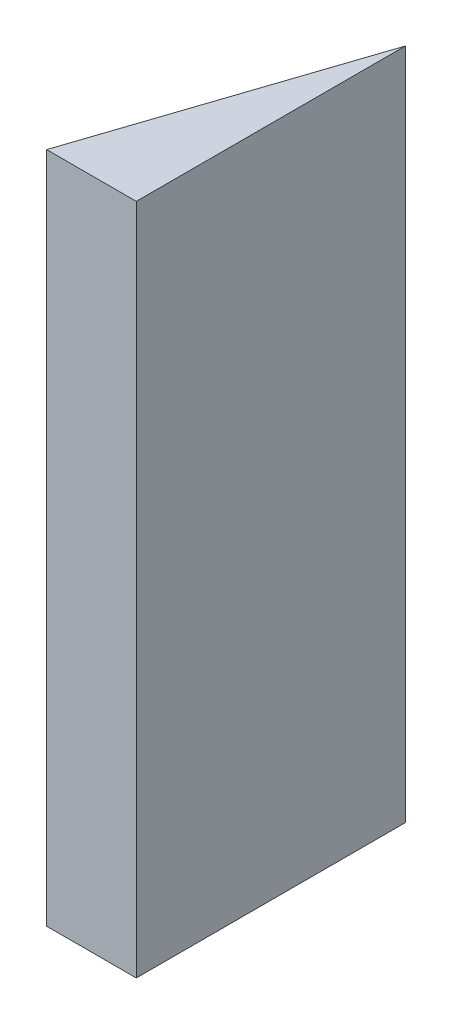
ISO-10303-21;
HEADER;
FILE_DESCRIPTION(('STEP AP214'),'2;1');
FILE_NAME('part.step','',(''),(''),'','','');
FILE_SCHEMA(('AUTOMOTIVE_DESIGN { 1 0 10303 214 1 1 1 1 }'));
ENDSEC;
DATA;
#1=APPLICATION_CONTEXT('core data for automotive mechanical design processes');
#2=APPLICATION_PROTOCOL_DEFINITION('international standard','automotive_design',2000,#1);
#3=PRODUCT_CONTEXT('',#1,'mechanical');
#4=PRODUCT('Part','Part','',(#3));
#5=PRODUCT_RELATED_PRODUCT_CATEGORY('part','',(#4));
#6=PRODUCT_DEFINITION_FORMATION('','',#4);
#7=PRODUCT_DEFINITION_CONTEXT('part definition',#1,'design');
#8=PRODUCT_DEFINITION('design','',#6,#7);
#9=PRODUCT_DEFINITION_SHAPE('','',#8);
#10=(LENGTH_UNIT() NAMED_UNIT(*) SI_UNIT(.MILLI.,.METRE.));
#11=(NAMED_UNIT(*) PLANE_ANGLE_UNIT() SI_UNIT($,.RADIAN.));
#12=(NAMED_UNIT(*) SI_UNIT($,.STERADIAN.) SOLID_ANGLE_UNIT());
#13=UNCERTAINTY_MEASURE_WITH_UNIT(LENGTH_MEASURE(1.E-05),#10,'distance_accuracy_value','');
#14=(GEOMETRIC_REPRESENTATION_CONTEXT(3) GLOBAL_UNCERTAINTY_ASSIGNED_CONTEXT((#13)) GLOBAL_UNIT_ASSIGNED_CONTEXT((#10,
#11,#12)) REPRESENTATION_CONTEXT('',''));
#15=CARTESIAN_POINT('',(0.,0.,0.));
#16=DIRECTION('',(0.,0.,1.));
#17=DIRECTION('',(1.,0.,0.));
#18=AXIS2_PLACEMENT_3D('',#15,#16,#17);
#19=CARTESIAN_POINT('',(3.92,1.74999981815962,-3.67112136800623));
#20=DIRECTION('',(0.,1.,8.74227765734759E-08));
#21=DIRECTION('',(-1.,0.,0.));
#22=AXIS2_PLACEMENT_3D('',#19,#20,#21);
#23=PLANE('',#22);
#24=DIRECTION('',(-0.315990463967206,-8.2943440007124E-08,0.948762365759616));
#25=VECTOR('',#24,1.);
#26=CARTESIAN_POINT('',(3.9,1.74999981641117,-3.65112136800623));
#27=LINE('',#26,#25);
#28=CARTESIAN_POINT('',(3.9,1.74999981641017,-3.65112136800623));
#29=VERTEX_POINT('',#28);
#30=CARTESIAN_POINT('',(3.766777825356,1.74999978144106,-3.25112136800623));
#31=VERTEX_POINT('',#30);
#32=EDGE_CURVE('E11',#29,#31,#27,.T.);
#33=ORIENTED_EDGE('',*,*,#32,.T.);
#34=DIRECTION('',(1.,0.,0.));
#35=VECTOR('',#34,1.);
#36=CARTESIAN_POINT('',(3.766777825356,1.74999978144206,-3.25112136800623));
#37=LINE('',#36,#35);
#38=CARTESIAN_POINT('',(3.9,1.74999978144106,-3.25112136800623));
#39=VERTEX_POINT('',#38);
#40=EDGE_CURVE('E49',#31,#39,#37,.T.);
#41=ORIENTED_EDGE('',*,*,#40,.T.);
#42=DIRECTION('',(0.,8.74227762404085E-08,-0.999999999999996));
#43=VECTOR('',#42,1.);
#44=CARTESIAN_POINT('',(3.9,1.74999978144206,-3.25112136800623));
#45=LINE('',#44,#43);
#46=EDGE_CURVE('E47',#39,#29,#45,.T.);
#47=ORIENTED_EDGE('',*,*,#46,.T.);
#48=EDGE_LOOP('',(#33,#41,#47));
#49=FACE_BOUND('',#48,.T.);
#50=ADVANCED_FACE('F17',(#49),#23,.T.);
#51=CARTESIAN_POINT('',(3.92,0.749999818159625,-3.67112145542901));
#52=DIRECTION('',(0.,1.,8.74227765734759E-08));
#53=DIRECTION('',(-1.,0.,0.));
#54=AXIS2_PLACEMENT_3D('',#51,#52,#53);
#55=PLANE('',#54);
#56=DIRECTION('',(0.,8.74227767955201E-08,-0.999999999999996));
#57=VECTOR('',#56,1.);
#58=CARTESIAN_POINT('',(3.9,0.749999781442059,-3.25112145542901));
#59=LINE('',#58,#57);
#60=CARTESIAN_POINT('',(3.9,0.749999781443059,-3.25112145542901));
#61=VERTEX_POINT('',#60);
#62=CARTESIAN_POINT('',(3.9,0.749999816412169,-3.65112145542901));
#63=VERTEX_POINT('',#62);
#64=EDGE_CURVE('E24',#61,#63,#59,.T.);
#65=ORIENTED_EDGE('',*,*,#64,.F.);
#66=DIRECTION('',(1.,0.,0.));
#67=VECTOR('',#66,1.);
#68=CARTESIAN_POINT('',(3.766777825356,0.749999781442059,-3.25112145542901));
#69=LINE('',#68,#67);
#70=CARTESIAN_POINT('',(3.766777825356,0.749999781443059,-3.25112145542901));
#71=VERTEX_POINT('',#70);
#72=EDGE_CURVE('E53',#71,#61,#69,.T.);
#73=ORIENTED_EDGE('',*,*,#72,.F.);
#74=DIRECTION('',(-0.315990463967206,-8.29434405337929E-08,0.948762365759616));
#75=VECTOR('',#74,1.);
#76=CARTESIAN_POINT('',(3.9,0.749999816411169,-3.65112145542901));
#77=LINE('',#76,#75);
#78=EDGE_CURVE('E68',#63,#71,#77,.T.);
#79=ORIENTED_EDGE('',*,*,#78,.F.);
#80=EDGE_LOOP('',(#65,#73,#79));
#81=FACE_BOUND('',#80,.T.);
#82=ADVANCED_FACE('F73',(#81),#55,.F.);
#83=CARTESIAN_POINT('',(3.9,1.74999981641117,-3.65112136800623));
#84=DIRECTION('',(0.948762365759619,-2.76247637570875E-08,0.315990463967207));
#85=DIRECTION('',(-0.315990463967207,-8.29434403231256E-08,0.948762365759619));
#86=AXIS2_PLACEMENT_3D('',#83,#84,#85);
#87=PLANE('',#86);
#88=DIRECTION('',(0.,-0.999999999999996,-8.74227765734755E-08));
#89=VECTOR('',#88,1.);
#90=CARTESIAN_POINT('',(3.9,1.74999981641117,-3.65112136800624));
#91=LINE('',#90,#89);
#92=EDGE_CURVE('E59',#29,#63,#91,.T.);
#93=ORIENTED_EDGE('',*,*,#92,.T.);
#94=ORIENTED_EDGE('',*,*,#78,.T.);
#95=DIRECTION('',(0.,-0.999999999999996,-8.74227765734755E-08));
#96=VECTOR('',#95,1.);
#97=CARTESIAN_POINT('',(3.766777825356,1.74999978144206,-3.25112136800623));
#98=LINE('',#97,#96);
#99=EDGE_CURVE('E54',#31,#71,#98,.T.);
#100=ORIENTED_EDGE('',*,*,#99,.F.);
#101=ORIENTED_EDGE('',*,*,#32,.F.);
#102=EDGE_LOOP('',(#93,#94,#100,#101));
#103=FACE_BOUND('',#102,.T.);
#104=ADVANCED_FACE('F57',(#103),#87,.F.);
#105=CARTESIAN_POINT('',(3.766777825356,1.74999978144206,-3.25112136800623));
#106=DIRECTION('',(0.,8.74227765734759E-08,-1.));
#107=DIRECTION('',(1.,0.,0.));
#108=AXIS2_PLACEMENT_3D('',#105,#106,#107);
#109=PLANE('',#108);
#110=ORIENTED_EDGE('',*,*,#99,.T.);
#111=ORIENTED_EDGE('',*,*,#72,.T.);
#112=DIRECTION('',(0.,-0.999999999999996,-8.74227765734755E-08));
#113=VECTOR('',#112,1.);
#114=CARTESIAN_POINT('',(3.9,1.74999978144206,-3.25112136800623));
#115=LINE('',#114,#113);
#116=EDGE_CURVE('E70',#39,#61,#115,.T.);
#117=ORIENTED_EDGE('',*,*,#116,.F.);
#118=ORIENTED_EDGE('',*,*,#40,.F.);
#119=EDGE_LOOP('',(#110,#111,#117,#118));
#120=FACE_BOUND('',#119,.T.);
#121=ADVANCED_FACE('F72',(#120),#109,.F.);
#122=CARTESIAN_POINT('',(3.9,1.74999978144206,-3.25112136800623));
#123=DIRECTION('',(-1.,0.,0.));
#124=DIRECTION('',(0.,8.74227765734759E-08,-1.));
#125=AXIS2_PLACEMENT_3D('',#122,#123,#124);
#126=PLANE('',#125);
#127=ORIENTED_EDGE('',*,*,#116,.T.);
#128=ORIENTED_EDGE('',*,*,#64,.T.);
#129=ORIENTED_EDGE('',*,*,#92,.F.);
#130=ORIENTED_EDGE('',*,*,#46,.F.);
#131=EDGE_LOOP('',(#127,#128,#129,#130));
#132=FACE_BOUND('',#131,.T.);
#133=ADVANCED_FACE('F61',(#132),#126,.F.);
#134=CLOSED_SHELL('',(#50,#82,#104,#121,#133));
#135=MANIFOLD_SOLID_BREP('B1',#134);
#136=ADVANCED_BREP_SHAPE_REPRESENTATION('',(#18,#135),#14);
#137=SHAPE_DEFINITION_REPRESENTATION(#9,#136);
ENDSEC;
END-ISO-10303-21;
